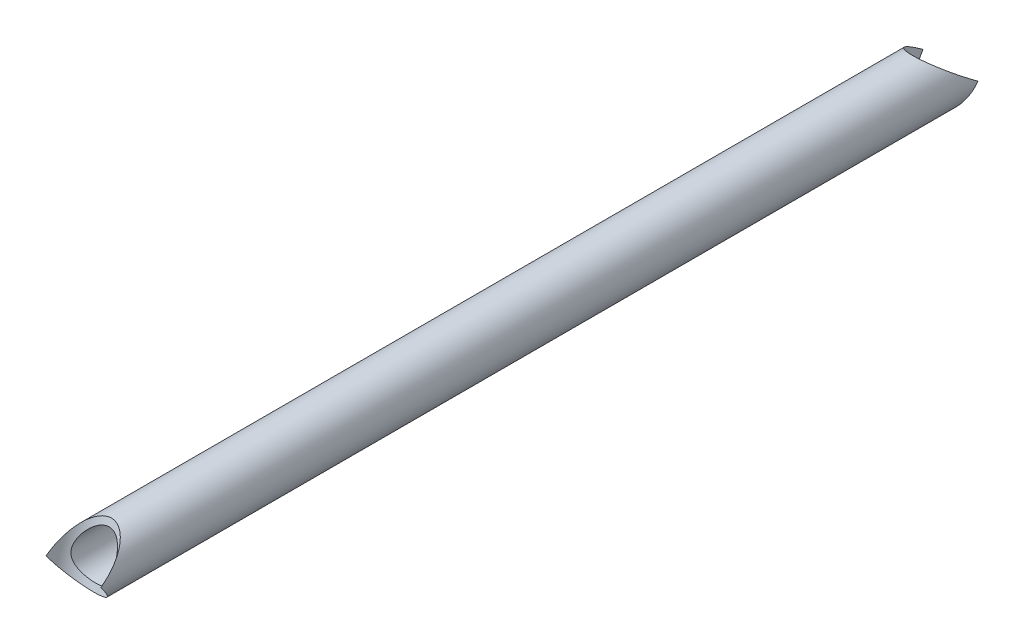
ISO-10303-21;
HEADER;
FILE_DESCRIPTION(('STEP AP214'),'2;1');
FILE_NAME('part.step','',(''),(''),'','','');
FILE_SCHEMA(('AUTOMOTIVE_DESIGN { 1 0 10303 214 1 1 1 1 }'));
ENDSEC;
DATA;
#1=APPLICATION_CONTEXT('core data for automotive mechanical design processes');
#2=APPLICATION_PROTOCOL_DEFINITION('international standard','automotive_design',2000,#1);
#3=PRODUCT_CONTEXT('',#1,'mechanical');
#4=PRODUCT('Part','Part','',(#3));
#5=PRODUCT_RELATED_PRODUCT_CATEGORY('part','',(#4));
#6=PRODUCT_DEFINITION_FORMATION('','',#4);
#7=PRODUCT_DEFINITION_CONTEXT('part definition',#1,'design');
#8=PRODUCT_DEFINITION('design','',#6,#7);
#9=PRODUCT_DEFINITION_SHAPE('','',#8);
#10=(LENGTH_UNIT() NAMED_UNIT(*) SI_UNIT(.MILLI.,.METRE.));
#11=(NAMED_UNIT(*) PLANE_ANGLE_UNIT() SI_UNIT($,.RADIAN.));
#12=(NAMED_UNIT(*) SI_UNIT($,.STERADIAN.) SOLID_ANGLE_UNIT());
#13=UNCERTAINTY_MEASURE_WITH_UNIT(LENGTH_MEASURE(1.E-05),#10,'distance_accuracy_value','');
#14=(GEOMETRIC_REPRESENTATION_CONTEXT(3) GLOBAL_UNCERTAINTY_ASSIGNED_CONTEXT((#13)) GLOBAL_UNIT_ASSIGNED_CONTEXT((#10,
#11,#12)) REPRESENTATION_CONTEXT('',''));
#15=CARTESIAN_POINT('',(0.,0.,0.));
#16=DIRECTION('',(0.,0.,1.));
#17=DIRECTION('',(1.,0.,0.));
#18=AXIS2_PLACEMENT_3D('',#15,#16,#17);
#19=CARTESIAN_POINT('',(1799.99999999996,750.,-202.656542434233));
#20=DIRECTION('',(0.,0.,1.));
#21=DIRECTION('',(0.,-1.,0.));
#22=AXIS2_PLACEMENT_3D('',#19,#20,#21);
#23=CYLINDRICAL_SURFACE('',#22,12.7000000000001);
#24=CARTESIAN_POINT('',(1799.99999999996,750.,202.656542434233));
#25=DIRECTION('',(0.,0.809899948955348,0.586568046080014));
#26=DIRECTION('',(0.,-0.586568046080014,0.809899948955347));
#27=AXIS2_PLACEMENT_3D('',#24,#25,#26);
#28=ELLIPSE('',#27,21.6513669383683,12.7000000000001);
#29=CARTESIAN_POINT('',(1812.69999999996,750.,202.656542434233));
#30=VERTEX_POINT('',#29);
#31=CARTESIAN_POINT('',(1787.29999999996,750.,202.656542434233));
#32=VERTEX_POINT('',#31);
#33=EDGE_CURVE('E75',#30,#32,#28,.T.);
#34=ORIENTED_EDGE('',*,*,#33,.F.);
#35=CARTESIAN_POINT('',(1799.99999999996,750.,202.656542434233));
#36=DIRECTION('',(0.,-0.586568046080014,0.809899948955347));
#37=DIRECTION('',(0.,0.809899948955348,0.586568046080014));
#38=AXIS2_PLACEMENT_3D('',#35,#36,#37);
#39=ELLIPSE('',#38,15.6809492535235,12.7000000000001);
#40=EDGE_CURVE('E82',#32,#30,#39,.T.);
#41=ORIENTED_EDGE('',*,*,#40,.F.);
#42=EDGE_LOOP('',(#34,#41));
#43=FACE_BOUND('',#42,.T.);
#44=CARTESIAN_POINT('',(1799.99999999996,750.,-202.656542434233));
#45=DIRECTION('',(0.,-0.809899948955348,0.586568046080014));
#46=DIRECTION('',(0.,0.586568046080014,0.809899948955348));
#47=AXIS2_PLACEMENT_3D('',#44,#45,#46);
#48=ELLIPSE('',#47,21.6513669383683,12.7000000000001);
#49=CARTESIAN_POINT('',(1787.29999999996,750.,-202.656542434233));
#50=VERTEX_POINT('',#49);
#51=CARTESIAN_POINT('',(1812.69999999996,750.,-202.656542434233));
#52=VERTEX_POINT('',#51);
#53=EDGE_CURVE('E58',#50,#52,#48,.F.);
#54=ORIENTED_EDGE('',*,*,#53,.F.);
#55=CARTESIAN_POINT('',(1799.99999999996,750.,-202.656542434233));
#56=DIRECTION('',(0.,0.586568046080014,0.809899948955348));
#57=DIRECTION('',(0.,-0.809899948955348,0.586568046080014));
#58=AXIS2_PLACEMENT_3D('',#55,#56,#57);
#59=ELLIPSE('',#58,15.6809492535235,12.7000000000001);
#60=EDGE_CURVE('E94',#52,#50,#59,.F.);
#61=ORIENTED_EDGE('',*,*,#60,.F.);
#62=EDGE_LOOP('',(#54,#61));
#63=FACE_BOUND('',#62,.T.);
#64=ADVANCED_FACE('F44',(#43,#63),#23,.T.);
#65=CARTESIAN_POINT('',(1799.99999999996,313.578191864488,345.911093985641));
#66=DIRECTION('',(0.,0.950122861158082,-0.31187585463575));
#67=DIRECTION('',(0.,0.31187585463575,0.950122861158083));
#68=AXIS2_PLACEMENT_3D('',#65,#66,#67);
#69=CYLINDRICAL_SURFACE('',#68,12.7000000000001);
#70=CARTESIAN_POINT('',(1799.99999999996,740.35,192.457442508405));
#71=CARTESIAN_POINT('',(1800.25549487288,740.350001323021,192.457443622493));
#72=CARTESIAN_POINT('',(1800.51102005776,740.360158682982,192.462237696364));
#73=CARTESIAN_POINT('',(1801.02020769019,740.400679650956,192.481299084192));
#74=CARTESIAN_POINT('',(1801.27386920683,740.431052743669,192.495570844827));
#75=CARTESIAN_POINT('',(1801.77777285061,740.511731274688,192.533262770259));
#76=CARTESIAN_POINT('',(1802.02800812342,740.562071931625,192.556699098409));
#77=CARTESIAN_POINT('',(1802.52277876452,740.682119935979,192.612127119238));
#78=CARTESIAN_POINT('',(1802.7673147654,740.751825122821,192.644117857454));
#79=CARTESIAN_POINT('',(1803.24818803531,740.909589137486,192.715725480426));
#80=CARTESIAN_POINT('',(1803.4845527567,740.997577725796,192.75531313677));
#81=CARTESIAN_POINT('',(1803.94864011668,741.191256009569,192.841225094051));
#82=CARTESIAN_POINT('',(1804.17636252112,741.296946184235,192.887549577358));
#83=CARTESIAN_POINT('',(1804.62191045395,741.525149617215,192.98579696155));
#84=CARTESIAN_POINT('',(1804.83973703841,741.647661074751,193.037719263042));
#85=CARTESIAN_POINT('',(1805.2644830828,741.908655160884,193.145880137793));
#86=CARTESIAN_POINT('',(1805.47140170318,742.047139016225,193.202119042475));
#87=CARTESIAN_POINT('',(1805.88486235884,742.347558462195,193.320745857496));
#88=CARTESIAN_POINT('',(1806.09071254282,742.510380261104,193.383301561329));
#89=CARTESIAN_POINT('',(1806.48827673088,742.852030154122,193.509683779826));
#90=CARTESIAN_POINT('',(1806.67998943992,743.03085971127,193.573510410232));
#91=CARTESIAN_POINT('',(1807.04847644642,743.403771719313,193.700246977002));
#92=CARTESIAN_POINT('',(1807.2252438939,743.59786108654,193.763156482198));
#93=CARTESIAN_POINT('',(1807.56285695886,744.000442530672,193.885464860626));
#94=CARTESIAN_POINT('',(1807.72370494432,744.208932457671,193.944864255448));
#95=CARTESIAN_POINT('',(1808.00586503641,744.607500702444,194.048805741095));
#96=CARTESIAN_POINT('',(1808.12949898293,744.79570400977,194.094243514559));
#97=CARTESIAN_POINT('',(1808.36389151701,745.181418667805,194.17827695509));
#98=CARTESIAN_POINT('',(1808.47465239622,745.378928352975,194.216873840611));
#99=CARTESIAN_POINT('',(1808.68241076884,745.782226491587,194.284801348342));
#100=CARTESIAN_POINT('',(1808.77942949396,745.988001529347,194.314146352706));
#101=CARTESIAN_POINT('',(1808.95908020595,746.407047869773,194.361086526165));
#102=CARTESIAN_POINT('',(1809.04171556416,746.620317401672,194.378684451422));
#103=CARTESIAN_POINT('',(1809.17802209854,747.013135936708,194.397666541575));
#104=CARTESIAN_POINT('',(1809.23422572469,747.191692734796,194.401433075631));
#105=CARTESIAN_POINT('',(1809.33612103124,747.551671328574,194.398195401329));
#106=CARTESIAN_POINT('',(1809.38181509837,747.733092463744,194.391193641261));
#107=CARTESIAN_POINT('',(1809.46240314622,748.097322571006,194.365483846722));
#108=CARTESIAN_POINT('',(1809.49730769211,748.280130004714,194.34678731846));
#109=CARTESIAN_POINT('',(1809.55630991435,748.645840700654,194.297187596506));
#110=CARTESIAN_POINT('',(1809.58040744014,748.828743964184,194.266284232755));
#111=CARTESIAN_POINT('',(1809.6179444127,749.193053281423,194.192307085178));
#112=CARTESIAN_POINT('',(1809.63139029556,749.374460173605,194.149240672035));
#113=CARTESIAN_POINT('',(1809.64803300465,749.734564400215,194.05145907232));
#114=CARTESIAN_POINT('',(1809.65122982617,749.913261733396,193.996743880391));
#115=CARTESIAN_POINT('',(1809.64792758712,750.267080111384,193.876542333696));
#116=CARTESIAN_POINT('',(1809.64141882916,750.442197401888,193.811045264331));
#117=CARTESIAN_POINT('',(1809.61933491058,750.787991764668,193.670504152221));
#118=CARTESIAN_POINT('',(1809.60375698339,750.95866746542,193.595457201717));
#119=CARTESIAN_POINT('',(1809.55438111377,751.37859789749,193.397842930488));
#120=CARTESIAN_POINT('',(1809.51537872376,751.624847416442,193.270165722024));
#121=CARTESIAN_POINT('',(1809.42057265609,752.106070085262,193.000597826516));
#122=CARTESIAN_POINT('',(1809.36476006855,752.341037178363,192.858699628624));
#123=CARTESIAN_POINT('',(1809.23770761416,752.800771524353,192.563956842099));
#124=CARTESIAN_POINT('',(1809.16641633948,753.025501694764,192.411076941304));
#125=CARTESIAN_POINT('',(1809.00965259433,753.464530517462,192.09793927942));
#126=CARTESIAN_POINT('',(1808.92418087742,753.678829723269,191.937681910697));
#127=CARTESIAN_POINT('',(1808.69565857415,754.197928400123,191.534527439305));
#128=CARTESIAN_POINT('',(1808.54461852046,754.497002626095,191.288757395988));
#129=CARTESIAN_POINT('',(1808.21405160023,755.07571776881,190.79330278772));
#130=CARTESIAN_POINT('',(1808.03450921087,755.355347976,190.543616156899));
#131=CARTESIAN_POINT('',(1807.64702945255,755.895400680145,190.046285396392));
#132=CARTESIAN_POINT('',(1807.43912541094,756.15584517683,189.798639225894));
#133=CARTESIAN_POINT('',(1806.99390572254,756.657336019245,189.310443348592));
#134=CARTESIAN_POINT('',(1806.75660765288,756.898393817006,189.069889506233));
#135=CARTESIAN_POINT('',(1806.33495427416,757.283069761803,188.679017031083));
#136=CARTESIAN_POINT('',(1806.15910851009,757.432509014754,188.525209054726));
#137=CARTESIAN_POINT('',(1805.79311483468,757.721182189649,188.225024587417));
#138=CARTESIAN_POINT('',(1805.60296445181,757.860414339776,188.078649388044));
#139=CARTESIAN_POINT('',(1805.20840938185,758.127212001948,187.795747066043));
#140=CARTESIAN_POINT('',(1805.00403281708,758.254799440094,187.659201541821));
#141=CARTESIAN_POINT('',(1804.58045996108,758.497140691738,187.398004368798));
#142=CARTESIAN_POINT('',(1804.36126260159,758.611893578547,187.273353578923));
#143=CARTESIAN_POINT('',(1803.96165535103,758.801392178497,187.066328805229));
#144=CARTESIAN_POINT('',(1803.78426766834,758.879195375366,186.980911776346));
#145=CARTESIAN_POINT('',(1803.42129680177,759.025268891258,186.819948007434));
#146=CARTESIAN_POINT('',(1803.23571576256,759.093541685686,186.744398704712));
#147=CARTESIAN_POINT('',(1802.85690652499,759.219567107317,186.604522513021));
#148=CARTESIAN_POINT('',(1802.66367930949,759.277321081338,186.540194187375));
#149=CARTESIAN_POINT('',(1802.2705280698,759.381285446411,186.424126762712));
#150=CARTESIAN_POINT('',(1802.07060725257,759.427501278216,186.372381730407));
#151=CARTESIAN_POINT('',(1801.66326033196,759.507868711331,186.282251378498));
#152=CARTESIAN_POINT('',(1801.45578029441,759.541899143086,186.244000293015));
#153=CARTESIAN_POINT('',(1801.03682497571,759.596463351321,186.182608722936));
#154=CARTESIAN_POINT('',(1800.82534971824,759.616997207794,186.159468148781));
#155=CARTESIAN_POINT('',(1800.40049764253,759.644033353097,186.128990471407));
#156=CARTESIAN_POINT('',(1800.18712210694,759.650544478395,186.121643415859));
#157=CARTESIAN_POINT('',(1799.76047164025,759.64938437089,186.122952075674));
#158=CARTESIAN_POINT('',(1799.54719670084,759.641714652837,186.131606081859));
#159=CARTESIAN_POINT('',(1799.15254040148,759.614458148224,186.162328524437));
#160=CARTESIAN_POINT('',(1798.97086756373,759.596686753307,186.182353065573));
#161=CARTESIAN_POINT('',(1798.61031585242,759.551141487398,186.233604984466));
#162=CARTESIAN_POINT('',(1798.43143800559,759.523364026837,186.264836382548));
#163=CARTESIAN_POINT('',(1798.07762271828,759.458294040171,186.337865874386));
#164=CARTESIAN_POINT('',(1797.90268541324,759.421001187512,186.379664330789));
#165=CARTESIAN_POINT('',(1797.55760743819,759.337491796046,186.473049506639));
#166=CARTESIAN_POINT('',(1797.38746783468,759.291273290782,186.524638383023));
#167=CARTESIAN_POINT('',(1796.99946091007,759.174546553594,186.654568373228));
#168=CARTESIAN_POINT('',(1796.78360370861,759.100986500458,186.736201591388));
#169=CARTESIAN_POINT('',(1796.36247723364,758.941014319533,186.912914513668));
#170=CARTESIAN_POINT('',(1796.15721091011,758.854598636695,187.007997936901));
#171=CARTESIAN_POINT('',(1795.55755505863,758.577939411907,187.310740153673));
#172=CARTESIAN_POINT('',(1795.17967382371,758.370397563077,187.535762858711));
#173=CARTESIAN_POINT('',(1794.57022330676,757.983177373973,187.949079935163));
#174=CARTESIAN_POINT('',(1794.32752412505,757.812251719059,188.129730155375));
#175=CARTESIAN_POINT('',(1793.86438838897,757.454020578336,188.503271716658));
#176=CARTESIAN_POINT('',(1793.64396214969,757.266707577428,188.696168662731));
#177=CARTESIAN_POINT('',(1793.22430267246,756.877108448541,189.090809819131));
#178=CARTESIAN_POINT('',(1793.02511402581,756.674792271883,189.29257143563));
#179=CARTESIAN_POINT('',(1792.64761055721,756.256533226051,189.701282076314));
#180=CARTESIAN_POINT('',(1792.46929255225,756.040592442542,189.908230303619));
#181=CARTESIAN_POINT('',(1792.12586067422,755.586136827798,190.332926803768));
#182=CARTESIAN_POINT('',(1791.9616082846,755.347056026864,190.550765395093));
#183=CARTESIAN_POINT('',(1791.65471745772,754.854180066541,190.985197268986));
#184=CARTESIAN_POINT('',(1791.51208465764,754.600381093244,191.201790212644));
#185=CARTESIAN_POINT('',(1791.24902881245,754.077797945792,191.629194043515));
#186=CARTESIAN_POINT('',(1791.12856353348,753.809043564991,191.840015260545));
#187=CARTESIAN_POINT('',(1790.91061743301,753.254877419365,192.251317490749));
#188=CARTESIAN_POINT('',(1790.81312276071,752.969475822676,192.451804677857));
#189=CARTESIAN_POINT('',(1790.6771616148,752.498200186587,192.75937148386));
#190=CARTESIAN_POINT('',(1790.63067064921,752.318095291124,192.871779890098));
#191=CARTESIAN_POINT('',(1790.54741881902,751.951059653571,193.088954481222));
#192=CARTESIAN_POINT('',(1790.51065952968,751.764127811982,193.193719426891));
#193=CARTESIAN_POINT('',(1790.44777271521,751.383680554363,193.393573852416));
#194=CARTESIAN_POINT('',(1790.4216323178,751.190173419305,193.488674941304));
#195=CARTESIAN_POINT('',(1790.38091806364,750.79676597927,193.667270563039));
#196=CARTESIAN_POINT('',(1790.36633805969,750.596869130917,193.750771244859));
#197=CARTESIAN_POINT('',(1790.34964488383,750.18842971268,193.905333319202));
#198=CARTESIAN_POINT('',(1790.34771583569,749.979803744319,193.976196452484));
#199=CARTESIAN_POINT('',(1790.35781555688,749.558156032711,194.102184646032));
#200=CARTESIAN_POINT('',(1790.36984327894,749.345134620461,194.157310886757));
#201=CARTESIAN_POINT('',(1790.40856621859,748.916918714584,194.250691423387));
#202=CARTESIAN_POINT('',(1790.43524860618,748.701726283196,194.288960424876));
#203=CARTESIAN_POINT('',(1790.50358832469,748.271383818422,194.348553961859));
#204=CARTESIAN_POINT('',(1790.54524469887,748.056233783204,194.369879579651));
#205=CARTESIAN_POINT('',(1790.63588394245,747.661104269435,194.394437457272));
#206=CARTESIAN_POINT('',(1790.68277416739,747.480774887015,194.399936803821));
#207=CARTESIAN_POINT('',(1790.78694036957,747.123067159137,194.400409801545));
#208=CARTESIAN_POINT('',(1790.84422022304,746.945689942152,194.395379516839));
#209=CARTESIAN_POINT('',(1790.96882938514,746.594833647064,194.376025860103));
#210=CARTESIAN_POINT('',(1791.03616917142,746.421358852778,194.361692746282));
#211=CARTESIAN_POINT('',(1791.18042332613,746.079280000255,194.325102471177));
#212=CARTESIAN_POINT('',(1791.25733997726,745.910677115112,194.302843418336));
#213=CARTESIAN_POINT('',(1791.45349474402,745.511420290724,194.241391936386));
#214=CARTESIAN_POINT('',(1791.57721416672,745.283449226378,194.198994951274));
#215=CARTESIAN_POINT('',(1791.84161472563,744.839569213609,194.104885896625));
#216=CARTESIAN_POINT('',(1791.9823018102,744.623664534355,194.053170557186));
#217=CARTESIAN_POINT('',(1792.27977036748,744.204602032014,193.943577939414));
#218=CARTESIAN_POINT('',(1792.43656711958,744.001456610333,193.885694809198));
#219=CARTESIAN_POINT('',(1792.76525293462,743.608875504925,193.766578538638));
#220=CARTESIAN_POINT('',(1792.93714056116,743.419438519505,193.705345717336));
#221=CARTESIAN_POINT('',(1793.29826092813,743.051856941739,193.580852366665));
#222=CARTESIAN_POINT('',(1793.48773855288,742.873958594179,193.51757506114));
#223=CARTESIAN_POINT('',(1793.88064626233,742.53384150912,193.392173068986));
#224=CARTESIAN_POINT('',(1794.08407664852,742.371623110617,193.3300484073));
#225=CARTESIAN_POINT('',(1794.50399080142,742.063744048421,193.208846212577));
#226=CARTESIAN_POINT('',(1794.72047529117,741.918084303191,193.149768848664));
#227=CARTESIAN_POINT('',(1795.1654456827,741.644294048444,193.036342385922));
#228=CARTESIAN_POINT('',(1795.39393154046,741.516163474658,192.981993269757));
#229=CARTESIAN_POINT('',(1795.87570590617,741.27131159708,192.876436030639));
#230=CARTESIAN_POINT('',(1796.12966047647,741.15573141817,192.825610328285));
#231=CARTESIAN_POINT('',(1796.64804191089,740.94654757622,192.732459102261));
#232=CARTESIAN_POINT('',(1796.91247065245,740.852947874092,192.69013511081));
#233=CARTESIAN_POINT('',(1797.44914912554,740.689027614362,192.61535969527));
#234=CARTESIAN_POINT('',(1797.72137977262,740.618654775917,192.582886112645));
#235=CARTESIAN_POINT('',(1798.2718415182,740.501839816053,192.528686956707));
#236=CARTESIAN_POINT('',(1798.55006873468,740.455382669913,192.506954635679));
#237=CARTESIAN_POINT('',(1799.0239031941,740.397505462288,192.479810169177));
#238=CARTESIAN_POINT('',(1799.21858824696,740.379702873918,192.471433839901));
#239=CARTESIAN_POINT('',(1799.60884294999,740.355949683136,192.460249605056));
#240=CARTESIAN_POINT('',(1799.80441259316,740.349998987196,192.457441655544));
#241=CARTESIAN_POINT('',(1799.99999999996,740.35,192.457442508405));
#242=B_SPLINE_CURVE_WITH_KNOTS('',3,(#70,#71,#72,#73,#74,#75,#76,#77,#78,#79,#80,#81,#82,#83,
#84,#85,#86,#87,#88,#89,#90,#91,#92,#93,#94,#95,#96,#97,#98,#99,#100,#101,#102,#103,#104,#105,
#106,#107,#108,#109,#110,#111,#112,#113,#114,#115,#116,#117,#118,#119,#120,#121,#122,#123,#124,
#125,#126,#127,#128,#129,#130,#131,#132,#133,#134,#135,#136,#137,#138,#139,#140,#141,#142,#143,
#144,#145,#146,#147,#148,#149,#150,#151,#152,#153,#154,#155,#156,#157,#158,#159,#160,#161,#162,
#163,#164,#165,#166,#167,#168,#169,#170,#171,#172,#173,#174,#175,#176,#177,#178,#179,#180,#181,
#182,#183,#184,#185,#186,#187,#188,#189,#190,#191,#192,#193,#194,#195,#196,#197,#198,#199,#200,
#201,#202,#203,#204,#205,#206,#207,#208,#209,#210,#211,#212,#213,#214,#215,#216,#217,#218,#219,
#220,#221,#222,#223,#224,#225,#226,#227,#228,#229,#230,#231,#232,#233,#234,#235,#236,#237,#238,
#239,#240,#241),.UNSPECIFIED.,.T.,.F.,(4,2,2,2,2,2,2,2,2,2,2,2,2,2,2,2,2,2,2,2,2,2,2,2,2,2,2,2,
2,2,2,2,2,2,2,2,2,2,2,2,2,2,2,2,2,2,2,2,2,2,2,2,2,2,2,2,2,2,2,2,2,2,2,2,2,2,2,2,2,2,2,2,2,2,2,2,
2,2,2,2,2,2,2,2,2,4),(0.,0.766291926195464,1.53294363049779,2.30095360517248,3.0688779244002,
3.83390490849069,4.59895260612126,5.36391846636314,6.12894311822342,6.93751371653178,
7.74615829026181,8.55517150941467,9.36406420838398,10.0526235118687,10.7410600502143,
11.4284210685424,12.1156207579064,12.6767400225528,13.2377317293871,13.7981723558383,
14.3586207902745,14.9187303247367,15.4788401167754,16.0395099214707,16.6003508498326,
17.4393160703436,18.2787267509923,19.1209691319105,19.9631667703063,21.2080852878345,
22.4536841488168,23.6978317349493,24.9412389010381,25.7726609367374,26.6042269561632,
27.4341934239309,28.2642197788698,28.898775998303,29.5331670916535,30.1674769010515,
30.8014870375264,31.4416371939636,32.0817835562693,32.7215264101874,33.3612009328634,
33.9114722405448,34.4619411490766,35.012428951454,35.5630381734053,36.2885801904595,
37.0143232205675,38.467004435052,39.5083137067678,40.550103042663,41.5940383851388,
42.6378143071284,43.7251452635676,44.8127592492205,45.8982791448184,46.9831428093101,
47.6347703364725,48.2865032769063,48.9374438085458,49.5880379718326,50.2480803501741,
50.9080732042538,51.5674891610769,52.2268629928234,52.7854657775879,53.3442774003005,
53.9036751487813,54.4632064893344,55.2505322149401,56.0381347608199,56.8264913373154,
57.6147729564718,58.4164343230603,59.2181130173692,60.0198361568403,60.8215563567211,
61.6712389295705,62.5210744991078,63.3689839355375,64.2163600318931,64.8029793708447,
65.3895940805179),.UNSPECIFIED.);
#243=CARTESIAN_POINT('',(1799.99999999996,740.35,192.457442508405));
#244=VERTEX_POINT('',#243);
#245=EDGE_CURVE('E89',#244,#244,#242,.T.);
#246=ORIENTED_EDGE('',*,*,#245,.F.);
#247=EDGE_LOOP('',(#246));
#248=FACE_BOUND('',#247,.T.);
#249=ORIENTED_EDGE('',*,*,#33,.T.);
#250=ORIENTED_EDGE('',*,*,#40,.T.);
#251=EDGE_LOOP('',(#249,#250));
#252=FACE_BOUND('',#251,.T.);
#253=ADVANCED_FACE('F83',(#248,#252),#69,.F.);
#254=CARTESIAN_POINT('',(1799.99999999996,1128.44535180018,-78.4326421885894));
#255=DIRECTION('',(0.,-0.950122861158083,-0.311875854635749));
#256=DIRECTION('',(0.,0.311875854635749,-0.950122861158082));
#257=AXIS2_PLACEMENT_3D('',#254,#255,#256);
#258=CYLINDRICAL_SURFACE('',#257,12.7000000000001);
#259=CARTESIAN_POINT('',(1799.99999999996,740.35,-192.457442508405));
#260=CARTESIAN_POINT('',(1799.74450512705,740.350001323021,-192.457443622493));
#261=CARTESIAN_POINT('',(1799.48897994216,740.360158682982,-192.462237696364));
#262=CARTESIAN_POINT('',(1798.97979230974,740.400679650956,-192.481299084192));
#263=CARTESIAN_POINT('',(1798.7261307931,740.431052743669,-192.495570844827));
#264=CARTESIAN_POINT('',(1798.22222714932,740.511731274689,-192.533262770259));
#265=CARTESIAN_POINT('',(1797.9719918765,740.562071931625,-192.556699098409));
#266=CARTESIAN_POINT('',(1797.4772212354,740.68211993598,-192.612127119238));
#267=CARTESIAN_POINT('',(1797.23268523452,740.751825122822,-192.644117857454));
#268=CARTESIAN_POINT('',(1796.75181196462,740.909589137486,-192.715725480426));
#269=CARTESIAN_POINT('',(1796.51544724323,740.997577725797,-192.75531313677));
#270=CARTESIAN_POINT('',(1796.05135988324,741.19125600957,-192.841225094051));
#271=CARTESIAN_POINT('',(1795.8236374788,741.296946184235,-192.887549577357));
#272=CARTESIAN_POINT('',(1795.37808954597,741.525149617216,-192.98579696155));
#273=CARTESIAN_POINT('',(1795.16026296152,741.647661074751,-193.037719263042));
#274=CARTESIAN_POINT('',(1794.73551691712,741.908655160884,-193.145880137793));
#275=CARTESIAN_POINT('',(1794.52859829675,742.047139016226,-193.202119042475));
#276=CARTESIAN_POINT('',(1794.11513764109,742.347558462195,-193.320745857496));
#277=CARTESIAN_POINT('',(1793.90928745711,742.510380261104,-193.383301561329));
#278=CARTESIAN_POINT('',(1793.51172326905,742.852030154122,-193.509683779826));
#279=CARTESIAN_POINT('',(1793.32001056,743.030859711271,-193.573510410232));
#280=CARTESIAN_POINT('',(1792.9515235535,743.403771719313,-193.700246977002));
#281=CARTESIAN_POINT('',(1792.77475610602,743.59786108654,-193.763156482198));
#282=CARTESIAN_POINT('',(1792.43714304106,744.000442530672,-193.885464860626));
#283=CARTESIAN_POINT('',(1792.2762950556,744.208932457671,-193.944864255447));
#284=CARTESIAN_POINT('',(1791.99413496352,744.607500702445,-194.048805741095));
#285=CARTESIAN_POINT('',(1791.870501017,744.79570400977,-194.094243514559));
#286=CARTESIAN_POINT('',(1791.63610848292,745.181418667805,-194.17827695509));
#287=CARTESIAN_POINT('',(1791.5253476037,745.378928352975,-194.216873840611));
#288=CARTESIAN_POINT('',(1791.31758923109,745.782226491587,-194.284801348342));
#289=CARTESIAN_POINT('',(1791.22057050596,745.988001529347,-194.314146352705));
#290=CARTESIAN_POINT('',(1791.04091979397,746.407047869773,-194.361086526165));
#291=CARTESIAN_POINT('',(1790.95828443577,746.620317401673,-194.378684451422));
#292=CARTESIAN_POINT('',(1790.82197790139,747.013135936708,-194.397666541575));
#293=CARTESIAN_POINT('',(1790.76577427523,747.191692734796,-194.401433075631));
#294=CARTESIAN_POINT('',(1790.66387896869,747.551671328574,-194.398195401328));
#295=CARTESIAN_POINT('',(1790.61818490156,747.733092463744,-194.391193641261));
#296=CARTESIAN_POINT('',(1790.53759685371,748.097322571006,-194.365483846722));
#297=CARTESIAN_POINT('',(1790.50269230782,748.280130004714,-194.34678731846));
#298=CARTESIAN_POINT('',(1790.44369008557,748.645840700654,-194.297187596506));
#299=CARTESIAN_POINT('',(1790.41959255979,748.828743964184,-194.266284232755));
#300=CARTESIAN_POINT('',(1790.38205558722,749.193053281423,-194.192307085177));
#301=CARTESIAN_POINT('',(1790.36860970437,749.374460173606,-194.149240672034));
#302=CARTESIAN_POINT('',(1790.35196699528,749.734564400216,-194.05145907232));
#303=CARTESIAN_POINT('',(1790.34877017376,749.913261733396,-193.996743880391));
#304=CARTESIAN_POINT('',(1790.35207241281,750.267080111384,-193.876542333696));
#305=CARTESIAN_POINT('',(1790.35858117077,750.442197401888,-193.811045264331));
#306=CARTESIAN_POINT('',(1790.38066508935,750.787991764669,-193.67050415222));
#307=CARTESIAN_POINT('',(1790.39624301654,750.95866746542,-193.595457201717));
#308=CARTESIAN_POINT('',(1790.44561888616,751.37859789749,-193.397842930488));
#309=CARTESIAN_POINT('',(1790.48462127617,751.624847416442,-193.270165722024));
#310=CARTESIAN_POINT('',(1790.57942734383,752.106070085262,-193.000597826515));
#311=CARTESIAN_POINT('',(1790.63523993138,752.341037178363,-192.858699628624));
#312=CARTESIAN_POINT('',(1790.76229238577,752.800771524354,-192.563956842099));
#313=CARTESIAN_POINT('',(1790.83358366045,753.025501694764,-192.411076941304));
#314=CARTESIAN_POINT('',(1790.99034740559,753.464530517462,-192.09793927942));
#315=CARTESIAN_POINT('',(1791.07581912251,753.678829723269,-191.937681910697));
#316=CARTESIAN_POINT('',(1791.30434142577,754.197928400123,-191.534527439305));
#317=CARTESIAN_POINT('',(1791.45538147946,754.497002626095,-191.288757395988));
#318=CARTESIAN_POINT('',(1791.78594839969,755.07571776881,-190.79330278772));
#319=CARTESIAN_POINT('',(1791.96549078906,755.355347975999,-190.5436161569));
#320=CARTESIAN_POINT('',(1792.35297054738,755.895400680145,-190.046285396392));
#321=CARTESIAN_POINT('',(1792.56087458898,756.15584517683,-189.798639225894));
#322=CARTESIAN_POINT('',(1793.00609427739,756.657336019244,-189.310443348592));
#323=CARTESIAN_POINT('',(1793.24339234705,756.898393817006,-189.069889506233));
#324=CARTESIAN_POINT('',(1793.66504572577,757.283069761803,-188.679017031083));
#325=CARTESIAN_POINT('',(1793.84089148984,757.432509014754,-188.525209054726));
#326=CARTESIAN_POINT('',(1794.20688516525,757.721182189649,-188.225024587417));
#327=CARTESIAN_POINT('',(1794.39703554812,757.860414339776,-188.078649388044));
#328=CARTESIAN_POINT('',(1794.79159061807,758.127212001948,-187.795747066043));
#329=CARTESIAN_POINT('',(1794.99596718285,758.254799440094,-187.659201541821));
#330=CARTESIAN_POINT('',(1795.41954003884,758.497140691738,-187.398004368798));
#331=CARTESIAN_POINT('',(1795.63873739833,758.611893578547,-187.273353578923));
#332=CARTESIAN_POINT('',(1796.03834464889,758.801392178497,-187.066328805229));
#333=CARTESIAN_POINT('',(1796.21573233159,758.879195375366,-186.980911776346));
#334=CARTESIAN_POINT('',(1796.57870319816,759.025268891258,-186.819948007434));
#335=CARTESIAN_POINT('',(1796.76428423736,759.093541685686,-186.744398704712));
#336=CARTESIAN_POINT('',(1797.14309347493,759.219567107317,-186.604522513021));
#337=CARTESIAN_POINT('',(1797.33632069043,759.277321081338,-186.540194187375));
#338=CARTESIAN_POINT('',(1797.72947193012,759.381285446411,-186.424126762711));
#339=CARTESIAN_POINT('',(1797.92939274735,759.427501278216,-186.372381730406));
#340=CARTESIAN_POINT('',(1798.33673966796,759.507868711331,-186.282251378498));
#341=CARTESIAN_POINT('',(1798.54421970551,759.541899143086,-186.244000293015));
#342=CARTESIAN_POINT('',(1798.96317502421,759.596463351321,-186.182608722935));
#343=CARTESIAN_POINT('',(1799.17465028168,759.616997207794,-186.15946814878));
#344=CARTESIAN_POINT('',(1799.59950235739,759.644033353097,-186.128990471407));
#345=CARTESIAN_POINT('',(1799.81287789299,759.650544478395,-186.121643415858));
#346=CARTESIAN_POINT('',(1800.23952835968,759.64938437089,-186.122952075674));
#347=CARTESIAN_POINT('',(1800.45280329909,759.641714652837,-186.131606081858));
#348=CARTESIAN_POINT('',(1800.84745959844,759.614458148224,-186.162328524437));
#349=CARTESIAN_POINT('',(1801.0291324362,759.596686753307,-186.182353065572));
#350=CARTESIAN_POINT('',(1801.38968414751,759.551141487398,-186.233604984466));
#351=CARTESIAN_POINT('',(1801.56856199433,759.523364026837,-186.264836382547));
#352=CARTESIAN_POINT('',(1801.92237728165,759.458294040171,-186.337865874386));
#353=CARTESIAN_POINT('',(1802.09731458669,759.421001187512,-186.379664330789));
#354=CARTESIAN_POINT('',(1802.44239256173,759.337491796046,-186.473049506639));
#355=CARTESIAN_POINT('',(1802.61253216525,759.291273290782,-186.524638383023));
#356=CARTESIAN_POINT('',(1803.00053908985,759.174546553594,-186.654568373228));
#357=CARTESIAN_POINT('',(1803.21639629132,759.100986500458,-186.736201591388));
#358=CARTESIAN_POINT('',(1803.63752276629,758.941014319533,-186.912914513668));
#359=CARTESIAN_POINT('',(1803.84278908982,758.854598636695,-187.007997936901));
#360=CARTESIAN_POINT('',(1804.4424449413,758.577939411906,-187.310740153673));
#361=CARTESIAN_POINT('',(1804.82032617622,758.370397563077,-187.535762858711));
#362=CARTESIAN_POINT('',(1805.42977669317,757.983177373973,-187.949079935163));
#363=CARTESIAN_POINT('',(1805.67247587488,757.812251719059,-188.129730155376));
#364=CARTESIAN_POINT('',(1806.13561161096,757.454020578335,-188.503271716658));
#365=CARTESIAN_POINT('',(1806.35603785024,757.266707577428,-188.696168662732));
#366=CARTESIAN_POINT('',(1806.77569732747,756.877108448541,-189.090809819131));
#367=CARTESIAN_POINT('',(1806.97488597412,756.674792271883,-189.29257143563));
#368=CARTESIAN_POINT('',(1807.35238944272,756.256533226051,-189.701282076314));
#369=CARTESIAN_POINT('',(1807.53070744768,756.040592442542,-189.90823030362));
#370=CARTESIAN_POINT('',(1807.87413932571,755.586136827798,-190.332926803768));
#371=CARTESIAN_POINT('',(1808.03839171533,755.347056026864,-190.550765395093));
#372=CARTESIAN_POINT('',(1808.34528254221,754.854180066541,-190.985197268986));
#373=CARTESIAN_POINT('',(1808.48791534229,754.600381093243,-191.201790212644));
#374=CARTESIAN_POINT('',(1808.75097118748,754.077797945792,-191.629194043515));
#375=CARTESIAN_POINT('',(1808.87143646645,753.80904356499,-191.840015260546));
#376=CARTESIAN_POINT('',(1809.08938256692,753.254877419365,-192.25131749075));
#377=CARTESIAN_POINT('',(1809.18687723922,752.969475822676,-192.451804677857));
#378=CARTESIAN_POINT('',(1809.32283838513,752.498200186587,-192.75937148386));
#379=CARTESIAN_POINT('',(1809.36932935072,752.318095291124,-192.871779890098));
#380=CARTESIAN_POINT('',(1809.4525811809,751.95105965357,-193.088954481222));
#381=CARTESIAN_POINT('',(1809.48934047024,751.764127811981,-193.193719426891));
#382=CARTESIAN_POINT('',(1809.55222728472,751.383680554362,-193.393573852416));
#383=CARTESIAN_POINT('',(1809.57836768213,751.190173419304,-193.488674941304));
#384=CARTESIAN_POINT('',(1809.61908193628,750.79676597927,-193.667270563039));
#385=CARTESIAN_POINT('',(1809.63366194023,750.596869130917,-193.750771244859));
#386=CARTESIAN_POINT('',(1809.6503551161,750.188429712679,-193.905333319202));
#387=CARTESIAN_POINT('',(1809.65228416424,749.979803744319,-193.976196452484));
#388=CARTESIAN_POINT('',(1809.64218444305,749.55815603271,-194.102184646032));
#389=CARTESIAN_POINT('',(1809.63015672099,749.34513462046,-194.157310886757));
#390=CARTESIAN_POINT('',(1809.59143378134,748.916918714583,-194.250691423387));
#391=CARTESIAN_POINT('',(1809.56475139375,748.701726283196,-194.288960424876));
#392=CARTESIAN_POINT('',(1809.49641167523,748.271383818421,-194.348553961859));
#393=CARTESIAN_POINT('',(1809.45475530106,748.056233783204,-194.369879579651));
#394=CARTESIAN_POINT('',(1809.36411605748,747.661104269435,-194.394437457272));
#395=CARTESIAN_POINT('',(1809.31722583253,747.480774887015,-194.399936803821));
#396=CARTESIAN_POINT('',(1809.21305963036,747.123067159137,-194.400409801545));
#397=CARTESIAN_POINT('',(1809.15577977689,746.945689942152,-194.395379516839));
#398=CARTESIAN_POINT('',(1809.03117061479,746.594833647064,-194.376025860103));
#399=CARTESIAN_POINT('',(1808.9638308285,746.421358852778,-194.361692746282));
#400=CARTESIAN_POINT('',(1808.8195766738,746.079280000255,-194.325102471177));
#401=CARTESIAN_POINT('',(1808.74266002267,745.910677115112,-194.302843418336));
#402=CARTESIAN_POINT('',(1808.54650525591,745.511420290724,-194.241391936386));
#403=CARTESIAN_POINT('',(1808.42278583321,745.283449226378,-194.198994951274));
#404=CARTESIAN_POINT('',(1808.1583852743,744.839569213609,-194.104885896625));
#405=CARTESIAN_POINT('',(1808.01769818972,744.623664534355,-194.053170557185));
#406=CARTESIAN_POINT('',(1807.72022963245,744.204602032013,-193.943577939413));
#407=CARTESIAN_POINT('',(1807.56343288034,744.001456610333,-193.885694809198));
#408=CARTESIAN_POINT('',(1807.2347470653,743.608875504925,-193.766578538637));
#409=CARTESIAN_POINT('',(1807.06285943877,743.419438519505,-193.705345717336));
#410=CARTESIAN_POINT('',(1806.7017390718,743.051856941739,-193.580852366665));
#411=CARTESIAN_POINT('',(1806.51226144705,742.873958594178,-193.51757506114));
#412=CARTESIAN_POINT('',(1806.1193537376,742.53384150912,-193.392173068986));
#413=CARTESIAN_POINT('',(1805.9159233514,742.371623110617,-193.330048407299));
#414=CARTESIAN_POINT('',(1805.49600919851,742.063744048421,-193.208846212577));
#415=CARTESIAN_POINT('',(1805.27952470875,741.918084303191,-193.149768848664));
#416=CARTESIAN_POINT('',(1804.83455431723,741.644294048444,-193.036342385922));
#417=CARTESIAN_POINT('',(1804.60606845946,741.516163474658,-192.981993269757));
#418=CARTESIAN_POINT('',(1804.12429409376,741.27131159708,-192.876436030639));
#419=CARTESIAN_POINT('',(1803.87033952346,741.15573141817,-192.825610328285));
#420=CARTESIAN_POINT('',(1803.35195808903,740.94654757622,-192.732459102261));
#421=CARTESIAN_POINT('',(1803.08752934747,740.852947874093,-192.69013511081));
#422=CARTESIAN_POINT('',(1802.55085087439,740.689027614362,-192.61535969527));
#423=CARTESIAN_POINT('',(1802.27862022731,740.618654775917,-192.582886112645));
#424=CARTESIAN_POINT('',(1801.72815848173,740.501839816053,-192.528686956706));
#425=CARTESIAN_POINT('',(1801.44993126525,740.455382669913,-192.506954635679));
#426=CARTESIAN_POINT('',(1800.97609680582,740.397505462288,-192.479810169177));
#427=CARTESIAN_POINT('',(1800.78141175296,740.379702873918,-192.471433839901));
#428=CARTESIAN_POINT('',(1800.39115704994,740.355949683137,-192.460249605056));
#429=CARTESIAN_POINT('',(1800.19558740676,740.349998987196,-192.457441655544));
#430=CARTESIAN_POINT('',(1799.99999999996,740.35,-192.457442508405));
#431=B_SPLINE_CURVE_WITH_KNOTS('',3,(#259,#260,#261,#262,#263,#264,#265,#266,#267,#268,#269,
#270,#271,#272,#273,#274,#275,#276,#277,#278,#279,#280,#281,#282,#283,#284,#285,#286,#287,#288,
#289,#290,#291,#292,#293,#294,#295,#296,#297,#298,#299,#300,#301,#302,#303,#304,#305,#306,#307,
#308,#309,#310,#311,#312,#313,#314,#315,#316,#317,#318,#319,#320,#321,#322,#323,#324,#325,#326,
#327,#328,#329,#330,#331,#332,#333,#334,#335,#336,#337,#338,#339,#340,#341,#342,#343,#344,#345,
#346,#347,#348,#349,#350,#351,#352,#353,#354,#355,#356,#357,#358,#359,#360,#361,#362,#363,#364,
#365,#366,#367,#368,#369,#370,#371,#372,#373,#374,#375,#376,#377,#378,#379,#380,#381,#382,#383,
#384,#385,#386,#387,#388,#389,#390,#391,#392,#393,#394,#395,#396,#397,#398,#399,#400,#401,#402,
#403,#404,#405,#406,#407,#408,#409,#410,#411,#412,#413,#414,#415,#416,#417,#418,#419,#420,#421,
#422,#423,#424,#425,#426,#427,#428,#429,#430),.UNSPECIFIED.,.T.,.F.,(4,2,2,2,2,2,2,2,2,2,2,2,2,
2,2,2,2,2,2,2,2,2,2,2,2,2,2,2,2,2,2,2,2,2,2,2,2,2,2,2,2,2,2,2,2,2,2,2,2,2,2,2,2,2,2,2,2,2,2,2,2,
2,2,2,2,2,2,2,2,2,2,2,2,2,2,2,2,2,2,2,2,2,2,2,2,4),(0.,0.766291926195464,1.53294363049779,
2.3009536051725,3.0688779244002,3.83390490849094,4.5989526061215,5.36391846636364,
6.12894311822341,6.9375137165321,7.74615829026156,8.55517150941433,9.36406420838388,
10.0526235118686,10.7410600502142,11.4284210685423,12.1156207579063,12.6767400225527,
13.2377317293869,13.7981723558382,14.3586207902745,14.9187303247367,15.4788401167755,
16.0395099214708,16.6003508498326,17.4393160703437,18.2787267509923,19.1209691319103,
19.9631667703061,21.2080852878343,22.4536841488162,23.6978317349485,24.9412389010376,
25.7726609367371,26.6042269561628,27.4341934239311,28.2642197788695,28.8987759983028,
29.5331670916532,30.1674769010509,30.8014870375263,31.4416371939635,32.0817835562695,
32.7215264101874,33.3612009328636,33.9114722405449,34.461941149077,35.0124289514544,
35.5630381734058,36.2885801904599,37.0143232205678,38.4670044350525,39.5083137067682,
40.5501030426636,41.5940383851395,42.6378143071292,43.7251452635683,44.8127592492214,
45.8982791448192,46.9831428093112,47.6347703364734,48.2865032769071,48.9374438085466,
49.5880379718333,50.2480803501749,50.9080732042546,51.5674891610777,52.226862992824,
52.7854657775883,53.3442774003008,53.9036751487816,54.4632064893347,55.2505322149407,
56.0381347608206,56.826491337316,57.6147729564724,58.4164343230606,59.2181130173697,
60.0198361568405,60.8215563567216,61.671238929571,62.521074499108,63.3689839355382,
64.2163600318937,64.8029793708451,65.3895940805179),.UNSPECIFIED.);
#432=CARTESIAN_POINT('',(1799.99999999996,740.35,-192.457442508405));
#433=VERTEX_POINT('',#432);
#434=EDGE_CURVE('E11',#433,#433,#431,.T.);
#435=ORIENTED_EDGE('',*,*,#434,.F.);
#436=EDGE_LOOP('',(#435));
#437=FACE_BOUND('',#436,.T.);
#438=ORIENTED_EDGE('',*,*,#53,.T.);
#439=ORIENTED_EDGE('',*,*,#60,.T.);
#440=EDGE_LOOP('',(#438,#439));
#441=FACE_BOUND('',#440,.T.);
#442=ADVANCED_FACE('F103',(#437,#441),#258,.F.);
#443=CARTESIAN_POINT('',(1799.99999999996,750.,-202.656542434233));
#444=DIRECTION('',(0.,0.,1.));
#445=DIRECTION('',(0.,-1.,0.));
#446=AXIS2_PLACEMENT_3D('',#443,#444,#445);
#447=CYLINDRICAL_SURFACE('',#446,9.65000000000003);
#448=ORIENTED_EDGE('',*,*,#245,.T.);
#449=EDGE_LOOP('',(#448));
#450=FACE_BOUND('',#449,.T.);
#451=ORIENTED_EDGE('',*,*,#434,.T.);
#452=EDGE_LOOP('',(#451));
#453=FACE_BOUND('',#452,.T.);
#454=ADVANCED_FACE('F46',(#450,#453),#447,.F.);
#455=CLOSED_SHELL('',(#64,#253,#442,#454));
#456=MANIFOLD_SOLID_BREP('B2',#455);
#457=ADVANCED_BREP_SHAPE_REPRESENTATION('',(#18,#456),#14);
#458=SHAPE_DEFINITION_REPRESENTATION(#9,#457);
ENDSEC;
END-ISO-10303-21;
